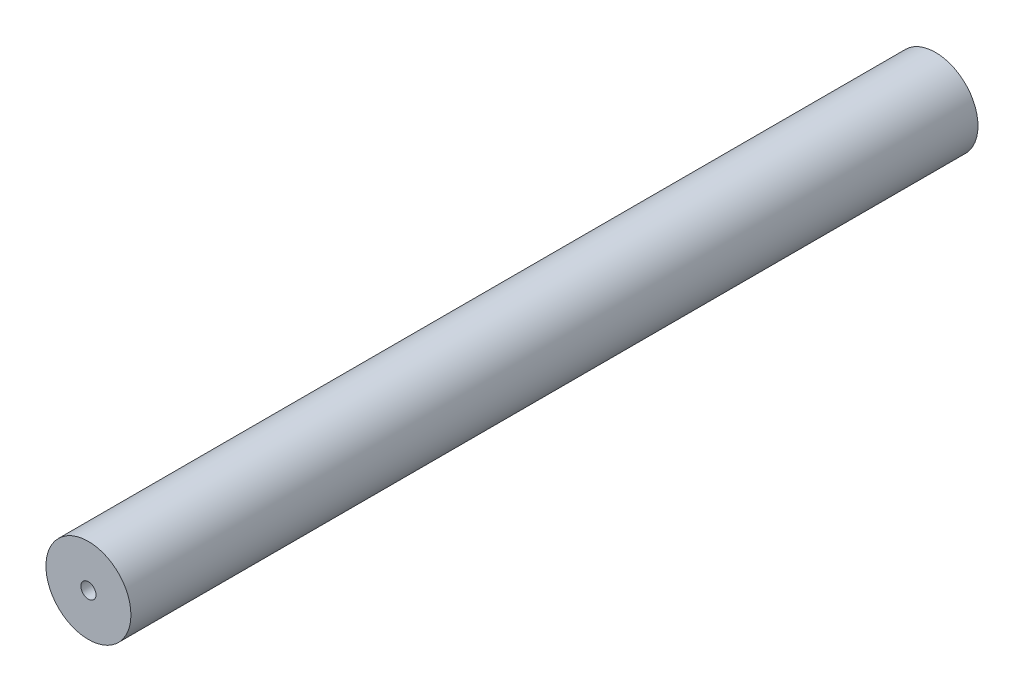
ISO-10303-21;
HEADER;
FILE_DESCRIPTION(('STEP AP214'),'2;1');
FILE_NAME('part.step','',(''),(''),'','','');
FILE_SCHEMA(('AUTOMOTIVE_DESIGN { 1 0 10303 214 1 1 1 1 }'));
ENDSEC;
DATA;
#1=APPLICATION_CONTEXT('core data for automotive mechanical design processes');
#2=APPLICATION_PROTOCOL_DEFINITION('international standard','automotive_design',2000,#1);
#3=PRODUCT_CONTEXT('',#1,'mechanical');
#4=PRODUCT('Part','Part','',(#3));
#5=PRODUCT_RELATED_PRODUCT_CATEGORY('part','',(#4));
#6=PRODUCT_DEFINITION_FORMATION('','',#4);
#7=PRODUCT_DEFINITION_CONTEXT('part definition',#1,'design');
#8=PRODUCT_DEFINITION('design','',#6,#7);
#9=PRODUCT_DEFINITION_SHAPE('','',#8);
#10=(LENGTH_UNIT() NAMED_UNIT(*) SI_UNIT(.MILLI.,.METRE.));
#11=(NAMED_UNIT(*) PLANE_ANGLE_UNIT() SI_UNIT($,.RADIAN.));
#12=(NAMED_UNIT(*) SI_UNIT($,.STERADIAN.) SOLID_ANGLE_UNIT());
#13=UNCERTAINTY_MEASURE_WITH_UNIT(LENGTH_MEASURE(1.E-05),#10,'distance_accuracy_value','');
#14=(GEOMETRIC_REPRESENTATION_CONTEXT(3) GLOBAL_UNCERTAINTY_ASSIGNED_CONTEXT((#13)) GLOBAL_UNIT_ASSIGNED_CONTEXT((#10,
#11,#12)) REPRESENTATION_CONTEXT('',''));
#15=CARTESIAN_POINT('',(0.,0.,0.));
#16=DIRECTION('',(0.,0.,1.));
#17=DIRECTION('',(1.,0.,0.));
#18=AXIS2_PLACEMENT_3D('',#15,#16,#17);
#19=CARTESIAN_POINT('',(0.,0.,44.85));
#20=DIRECTION('',(0.,0.,1.));
#21=DIRECTION('',(1.,0.,0.));
#22=AXIS2_PLACEMENT_3D('',#19,#20,#21);
#23=PLANE('',#22);
#24=CARTESIAN_POINT('',(0.,0.,44.85));
#25=DIRECTION('',(0.,0.,1.));
#26=DIRECTION('',(1.,0.,0.));
#27=AXIS2_PLACEMENT_3D('',#24,#25,#26);
#28=CIRCLE('',#27,2.25);
#29=CARTESIAN_POINT('',(2.25,0.,44.85));
#30=VERTEX_POINT('',#29);
#31=EDGE_CURVE('E10',#30,#30,#28,.T.);
#32=ORIENTED_EDGE('',*,*,#31,.T.);
#33=EDGE_LOOP('',(#32));
#34=FACE_BOUND('',#33,.T.);
#35=CARTESIAN_POINT('',(0.,0.,44.85));
#36=DIRECTION('',(0.,0.,1.));
#37=DIRECTION('',(1.,0.,0.));
#38=AXIS2_PLACEMENT_3D('',#35,#36,#37);
#39=CIRCLE('',#38,0.4);
#40=CARTESIAN_POINT('',(0.4,0.,44.85));
#41=VERTEX_POINT('',#40);
#42=EDGE_CURVE('E44',#41,#41,#39,.T.);
#43=ORIENTED_EDGE('',*,*,#42,.F.);
#44=EDGE_LOOP('',(#43));
#45=FACE_BOUND('',#44,.T.);
#46=ADVANCED_FACE('F33',(#34,#45),#23,.T.);
#47=CARTESIAN_POINT('',(0.,0.,0.));
#48=DIRECTION('',(0.,0.,1.));
#49=DIRECTION('',(1.,0.,0.));
#50=AXIS2_PLACEMENT_3D('',#47,#48,#49);
#51=PLANE('',#50);
#52=CARTESIAN_POINT('',(0.,0.,0.));
#53=DIRECTION('',(0.,0.,1.));
#54=DIRECTION('',(1.,0.,0.));
#55=AXIS2_PLACEMENT_3D('',#52,#53,#54);
#56=CIRCLE('',#55,2.25);
#57=CARTESIAN_POINT('',(2.25,0.,0.));
#58=VERTEX_POINT('',#57);
#59=EDGE_CURVE('E37',#58,#58,#56,.T.);
#60=ORIENTED_EDGE('',*,*,#59,.F.);
#61=EDGE_LOOP('',(#60));
#62=FACE_BOUND('',#61,.T.);
#63=CARTESIAN_POINT('',(0.,0.,0.));
#64=DIRECTION('',(0.,0.,1.));
#65=DIRECTION('',(1.,0.,0.));
#66=AXIS2_PLACEMENT_3D('',#63,#64,#65);
#67=CIRCLE('',#66,0.4);
#68=CARTESIAN_POINT('',(0.4,0.,0.));
#69=VERTEX_POINT('',#68);
#70=EDGE_CURVE('E46',#69,#69,#67,.T.);
#71=ORIENTED_EDGE('',*,*,#70,.T.);
#72=EDGE_LOOP('',(#71));
#73=FACE_BOUND('',#72,.T.);
#74=ADVANCED_FACE('F56',(#62,#73),#51,.F.);
#75=CARTESIAN_POINT('',(0.,0.,44.85));
#76=DIRECTION('',(0.,0.,-1.));
#77=DIRECTION('',(-1.,0.,0.));
#78=AXIS2_PLACEMENT_3D('',#75,#76,#77);
#79=CYLINDRICAL_SURFACE('',#78,2.25);
#80=ORIENTED_EDGE('',*,*,#31,.F.);
#81=EDGE_LOOP('',(#80));
#82=FACE_BOUND('',#81,.T.);
#83=ORIENTED_EDGE('',*,*,#59,.T.);
#84=EDGE_LOOP('',(#83));
#85=FACE_BOUND('',#84,.T.);
#86=ADVANCED_FACE('F35',(#82,#85),#79,.T.);
#87=CARTESIAN_POINT('',(0.,0.,44.85));
#88=DIRECTION('',(0.,0.,-1.));
#89=DIRECTION('',(-1.,0.,0.));
#90=AXIS2_PLACEMENT_3D('',#87,#88,#89);
#91=CYLINDRICAL_SURFACE('',#90,0.4);
#92=ORIENTED_EDGE('',*,*,#42,.T.);
#93=EDGE_LOOP('',(#92));
#94=FACE_BOUND('',#93,.T.);
#95=ORIENTED_EDGE('',*,*,#70,.F.);
#96=EDGE_LOOP('',(#95));
#97=FACE_BOUND('',#96,.T.);
#98=ADVANCED_FACE('F52',(#94,#97),#91,.F.);
#99=CLOSED_SHELL('',(#46,#74,#86,#98));
#100=MANIFOLD_SOLID_BREP('B2',#99);
#101=ADVANCED_BREP_SHAPE_REPRESENTATION('',(#18,#100),#14);
#102=SHAPE_DEFINITION_REPRESENTATION(#9,#101);
ENDSEC;
END-ISO-10303-21;
